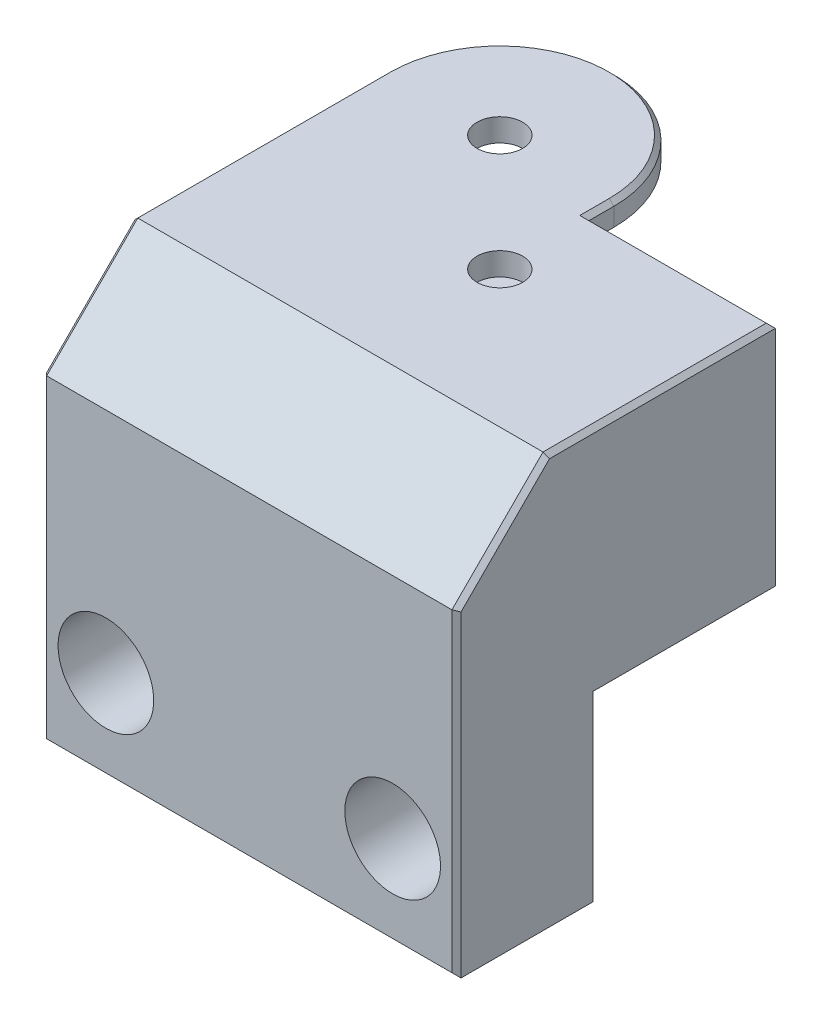
ISO-10303-21;
HEADER;
FILE_DESCRIPTION(('STEP AP214'),'2;1');
FILE_NAME('part.step','',(''),(''),'','','');
FILE_SCHEMA(('AUTOMOTIVE_DESIGN { 1 0 10303 214 1 1 1 1 }'));
ENDSEC;
DATA;
#1=APPLICATION_CONTEXT('core data for automotive mechanical design processes');
#2=APPLICATION_PROTOCOL_DEFINITION('international standard','automotive_design',2000,#1);
#3=PRODUCT_CONTEXT('',#1,'mechanical');
#4=PRODUCT('Part','Part','',(#3));
#5=PRODUCT_RELATED_PRODUCT_CATEGORY('part','',(#4));
#6=PRODUCT_DEFINITION_FORMATION('','',#4);
#7=PRODUCT_DEFINITION_CONTEXT('part definition',#1,'design');
#8=PRODUCT_DEFINITION('design','',#6,#7);
#9=PRODUCT_DEFINITION_SHAPE('','',#8);
#10=(LENGTH_UNIT() NAMED_UNIT(*) SI_UNIT(.MILLI.,.METRE.));
#11=(NAMED_UNIT(*) PLANE_ANGLE_UNIT() SI_UNIT($,.RADIAN.));
#12=(NAMED_UNIT(*) SI_UNIT($,.STERADIAN.) SOLID_ANGLE_UNIT());
#13=UNCERTAINTY_MEASURE_WITH_UNIT(LENGTH_MEASURE(1.E-05),#10,'distance_accuracy_value','');
#14=(GEOMETRIC_REPRESENTATION_CONTEXT(3) GLOBAL_UNCERTAINTY_ASSIGNED_CONTEXT((#13)) GLOBAL_UNIT_ASSIGNED_CONTEXT((#10,
#11,#12)) REPRESENTATION_CONTEXT('',''));
#15=CARTESIAN_POINT('',(0.,0.,0.));
#16=DIRECTION('',(0.,0.,1.));
#17=DIRECTION('',(1.,0.,0.));
#18=AXIS2_PLACEMENT_3D('',#15,#16,#17);
#19=CARTESIAN_POINT('',(50.2552086709145,-29.2919488059329,-12.7323956645428));
#20=DIRECTION('',(1.,0.,0.));
#21=DIRECTION('',(0.,0.,1.));
#22=AXIS2_PLACEMENT_3D('',#19,#20,#21);
#23=PLANE('',#22);
#24=DIRECTION('',(0.,0.,1.));
#25=VECTOR('',#24,1.);
#26=CARTESIAN_POINT('',(50.2552086709145,3.,-12.7323956645428));
#27=LINE('',#26,#25);
#28=CARTESIAN_POINT('',(50.2552086709145,3.,-12.7323956645428));
#29=VERTEX_POINT('',#28);
#30=CARTESIAN_POINT('',(50.2552086709145,3.,-10.));
#31=VERTEX_POINT('',#30);
#32=EDGE_CURVE('E254',#29,#31,#27,.T.);
#33=ORIENTED_EDGE('',*,*,#32,.T.);
#34=DIRECTION('',(0.,1.,0.));
#35=VECTOR('',#34,1.);
#36=CARTESIAN_POINT('',(50.2552086709145,-29.2919488059329,-10.));
#37=LINE('',#36,#35);
#38=CARTESIAN_POINT('',(50.2552086709145,0.,-10.));
#39=VERTEX_POINT('',#38);
#40=EDGE_CURVE('E272',#39,#31,#37,.T.);
#41=ORIENTED_EDGE('',*,*,#40,.F.);
#42=DIRECTION('',(0.,0.,-1.));
#43=VECTOR('',#42,1.);
#44=CARTESIAN_POINT('',(50.2552086709145,0.,-12.7323956645428));
#45=LINE('',#44,#43);
#46=CARTESIAN_POINT('',(50.2552086709145,0.,-12.7323956645428));
#47=VERTEX_POINT('',#46);
#48=EDGE_CURVE('E258',#39,#47,#45,.T.);
#49=ORIENTED_EDGE('',*,*,#48,.T.);
#50=DIRECTION('',(0.,1.,0.));
#51=VECTOR('',#50,1.);
#52=CARTESIAN_POINT('',(50.2552086709145,-29.2919488059329,-12.7323956645428));
#53=LINE('',#52,#51);
#54=EDGE_CURVE('E275',#47,#29,#53,.T.);
#55=ORIENTED_EDGE('',*,*,#54,.T.);
#56=EDGE_LOOP('',(#33,#41,#49,#55));
#57=FACE_BOUND('',#56,.T.);
#58=ADVANCED_FACE('F33',(#57),#23,.T.);
#59=CARTESIAN_POINT('',(37.7476043354572,-29.2919488059329,-12.7323956645428));
#60=DIRECTION('',(0.,1.,0.));
#61=DIRECTION('',(0.,0.,1.));
#62=AXIS2_PLACEMENT_3D('',#59,#60,#61);
#63=CYLINDRICAL_SURFACE('',#62,12.5076043354572);
#64=CARTESIAN_POINT('',(37.7476043354572,3.,-12.7323956645428));
#65=DIRECTION('',(0.,1.,0.));
#66=DIRECTION('',(0.,0.,-1.));
#67=AXIS2_PLACEMENT_3D('',#64,#65,#66);
#68=CIRCLE('',#67,12.5076043354572);
#69=CARTESIAN_POINT('',(25.24,3.,-12.7323956645428));
#70=VERTEX_POINT('',#69);
#71=EDGE_CURVE('E252',#70,#29,#68,.F.);
#72=ORIENTED_EDGE('',*,*,#71,.T.);
#73=ORIENTED_EDGE('',*,*,#54,.F.);
#74=CARTESIAN_POINT('',(37.7476043354572,0.,-12.7323956645428));
#75=DIRECTION('',(0.,-1.,0.));
#76=DIRECTION('',(0.,0.,1.));
#77=AXIS2_PLACEMENT_3D('',#74,#75,#76);
#78=CIRCLE('',#77,12.5076043354572);
#79=CARTESIAN_POINT('',(25.24,0.,-12.7323956645428));
#80=VERTEX_POINT('',#79);
#81=EDGE_CURVE('E262',#47,#80,#78,.F.);
#82=ORIENTED_EDGE('',*,*,#81,.T.);
#83=DIRECTION('',(0.,1.,0.));
#84=VECTOR('',#83,1.);
#85=CARTESIAN_POINT('',(25.24,-29.2919488059329,-12.7323956645428));
#86=LINE('',#85,#84);
#87=EDGE_CURVE('E265',#80,#70,#86,.T.);
#88=ORIENTED_EDGE('',*,*,#87,.T.);
#89=EDGE_LOOP('',(#72,#73,#82,#88));
#90=FACE_BOUND('',#89,.T.);
#91=ADVANCED_FACE('F487',(#90),#63,.T.);
#92=CARTESIAN_POINT('',(37.7476043354572,-29.2919488059329,-12.7323956645428));
#93=DIRECTION('',(0.,1.,0.));
#94=DIRECTION('',(0.,0.,1.));
#95=AXIS2_PLACEMENT_3D('',#92,#93,#94);
#96=CYLINDRICAL_SURFACE('',#95,2.5);
#97=CARTESIAN_POINT('',(37.7476043354572,3.,-12.7323956645428));
#98=DIRECTION('',(0.,1.,0.));
#99=DIRECTION('',(0.,0.,-1.));
#100=AXIS2_PLACEMENT_3D('',#97,#98,#99);
#101=CIRCLE('',#100,2.5);
#102=CARTESIAN_POINT('',(37.7476043354572,3.,-15.2323956645428));
#103=VERTEX_POINT('',#102);
#104=EDGE_CURVE('E251',#103,#103,#101,.F.);
#105=ORIENTED_EDGE('',*,*,#104,.F.);
#106=EDGE_LOOP('',(#105));
#107=FACE_BOUND('',#106,.T.);
#108=CARTESIAN_POINT('',(37.7476043354572,0.,-12.7323956645428));
#109=DIRECTION('',(0.,-1.,0.));
#110=DIRECTION('',(0.,0.,1.));
#111=AXIS2_PLACEMENT_3D('',#108,#109,#110);
#112=CIRCLE('',#111,2.5);
#113=CARTESIAN_POINT('',(37.7476043354572,0.,-10.2323956645428));
#114=VERTEX_POINT('',#113);
#115=EDGE_CURVE('E261',#114,#114,#112,.F.);
#116=ORIENTED_EDGE('',*,*,#115,.F.);
#117=EDGE_LOOP('',(#116));
#118=FACE_BOUND('',#117,.T.);
#119=ADVANCED_FACE('F546',(#107,#118),#96,.F.);
#120=CARTESIAN_POINT('',(70.72,25.,-10.));
#121=DIRECTION('',(0.,0.,1.));
#122=DIRECTION('',(-1.,0.,0.));
#123=AXIS2_PLACEMENT_3D('',#120,#121,#122);
#124=PLANE('',#123);
#125=CARTESIAN_POINT('',(50.2552086709145,22.5,-10.));
#126=VERTEX_POINT('',#125);
#127=CARTESIAN_POINT('',(50.2552086709145,24.5,-10.));
#128=VERTEX_POINT('',#127);
#129=EDGE_CURVE('E276',#126,#128,#37,.T.);
#130=ORIENTED_EDGE('',*,*,#129,.T.);
#131=DIRECTION('',(1.,0.,0.));
#132=VECTOR('',#131,1.);
#133=CARTESIAN_POINT('',(70.72,24.5,-10.));
#134=LINE('',#133,#132);
#135=CARTESIAN_POINT('',(70.72,24.5,-10.));
#136=VERTEX_POINT('',#135);
#137=EDGE_CURVE('E11',#128,#136,#134,.T.);
#138=ORIENTED_EDGE('',*,*,#137,.T.);
#139=DIRECTION('',(0.,-1.,0.));
#140=VECTOR('',#139,1.);
#141=CARTESIAN_POINT('',(70.72,25.,-10.));
#142=LINE('',#141,#140);
#143=CARTESIAN_POINT('',(70.72,0.,-10.));
#144=VERTEX_POINT('',#143);
#145=EDGE_CURVE('E334',#136,#144,#142,.T.);
#146=ORIENTED_EDGE('',*,*,#145,.T.);
#147=DIRECTION('',(1.,0.,0.));
#148=VECTOR('',#147,1.);
#149=CARTESIAN_POINT('',(70.72,0.,-10.));
#150=LINE('',#149,#148);
#151=EDGE_CURVE('E328',#39,#144,#150,.T.);
#152=ORIENTED_EDGE('',*,*,#151,.F.);
#153=ORIENTED_EDGE('',*,*,#40,.T.);
#154=DIRECTION('',(1.,0.,0.));
#155=VECTOR('',#154,1.);
#156=CARTESIAN_POINT('',(40.32,3.,-10.));
#157=LINE('',#156,#155);
#158=CARTESIAN_POINT('',(60.64,3.,-10.));
#159=VERTEX_POINT('',#158);
#160=EDGE_CURVE('E285',#31,#159,#157,.T.);
#161=ORIENTED_EDGE('',*,*,#160,.T.);
#162=DIRECTION('',(0.,1.,0.));
#163=VECTOR('',#162,1.);
#164=CARTESIAN_POINT('',(60.64,3.,-10.));
#165=LINE('',#164,#163);
#166=CARTESIAN_POINT('',(60.64,22.5,-10.));
#167=VERTEX_POINT('',#166);
#168=EDGE_CURVE('E291',#159,#167,#165,.T.);
#169=ORIENTED_EDGE('',*,*,#168,.T.);
#170=DIRECTION('',(1.,0.,0.));
#171=VECTOR('',#170,1.);
#172=CARTESIAN_POINT('',(40.32,22.5,-10.));
#173=LINE('',#172,#171);
#174=EDGE_CURVE('E294',#126,#167,#173,.T.);
#175=ORIENTED_EDGE('',*,*,#174,.F.);
#176=EDGE_LOOP('',(#130,#138,#146,#152,#153,#161,#169,#175));
#177=FACE_BOUND('',#176,.T.);
#178=ADVANCED_FACE('F478',(#177),#124,.F.);
#179=CARTESIAN_POINT('',(50.48,25.,0.));
#180=DIRECTION('',(0.,-1.,0.));
#181=DIRECTION('',(0.,0.,-1.));
#182=AXIS2_PLACEMENT_3D('',#179,#180,#181);
#183=CYLINDRICAL_SURFACE('',#182,2.5);
#184=CARTESIAN_POINT('',(50.48,25.,0.));
#185=DIRECTION('',(0.,-1.,0.));
#186=DIRECTION('',(0.,0.,1.));
#187=AXIS2_PLACEMENT_3D('',#184,#185,#186);
#188=CIRCLE('',#187,2.5);
#189=CARTESIAN_POINT('',(50.48,25.,2.5));
#190=VERTEX_POINT('',#189);
#191=EDGE_CURVE('E318',#190,#190,#188,.T.);
#192=ORIENTED_EDGE('',*,*,#191,.F.);
#193=EDGE_LOOP('',(#192));
#194=FACE_BOUND('',#193,.T.);
#195=CARTESIAN_POINT('',(50.48,22.5,0.));
#196=DIRECTION('',(0.,1.,0.));
#197=DIRECTION('',(0.,0.,-1.));
#198=AXIS2_PLACEMENT_3D('',#195,#196,#197);
#199=CIRCLE('',#198,2.5);
#200=CARTESIAN_POINT('',(50.48,22.5,-2.5));
#201=VERTEX_POINT('',#200);
#202=EDGE_CURVE('E301',#201,#201,#199,.T.);
#203=ORIENTED_EDGE('',*,*,#202,.F.);
#204=EDGE_LOOP('',(#203));
#205=FACE_BOUND('',#204,.T.);
#206=ADVANCED_FACE('F555',(#194,#205),#183,.F.);
#207=CARTESIAN_POINT('',(50.48,25.,0.));
#208=DIRECTION('',(0.,1.,0.));
#209=DIRECTION('',(0.,0.,1.));
#210=AXIS2_PLACEMENT_3D('',#207,#208,#209);
#211=PLANE('',#210);
#212=CARTESIAN_POINT('',(37.7476043354572,25.,-12.7323956645428));
#213=DIRECTION('',(0.,1.,0.));
#214=DIRECTION('',(0.,0.,1.));
#215=AXIS2_PLACEMENT_3D('',#212,#213,#214);
#216=CIRCLE('',#215,12.0076043354572);
#217=CARTESIAN_POINT('',(49.7552086709145,25.,-12.7323956645428));
#218=VERTEX_POINT('',#217);
#219=CARTESIAN_POINT('',(25.74,25.,-12.7323956645428));
#220=VERTEX_POINT('',#219);
#221=EDGE_CURVE('E377',#218,#220,#216,.T.);
#222=ORIENTED_EDGE('',*,*,#221,.T.);
#223=DIRECTION('',(0.,0.,1.));
#224=VECTOR('',#223,1.);
#225=CARTESIAN_POINT('',(25.74,25.,14.9999999999999));
#226=LINE('',#225,#224);
#227=CARTESIAN_POINT('',(25.74,25.,14.9999999999999));
#228=VERTEX_POINT('',#227);
#229=EDGE_CURVE('E379',#220,#228,#226,.T.);
#230=ORIENTED_EDGE('',*,*,#229,.T.);
#231=DIRECTION('',(-1.,0.,0.));
#232=VECTOR('',#231,1.);
#233=CARTESIAN_POINT('',(50.48,25.,14.9999999999999));
#234=LINE('',#233,#232);
#235=CARTESIAN_POINT('',(70.22,25.,14.9999999999999));
#236=VERTEX_POINT('',#235);
#237=EDGE_CURVE('E343',#236,#228,#234,.T.);
#238=ORIENTED_EDGE('',*,*,#237,.F.);
#239=DIRECTION('',(0.,0.,-1.));
#240=VECTOR('',#239,1.);
#241=CARTESIAN_POINT('',(70.22,25.,-10.));
#242=LINE('',#241,#240);
#243=CARTESIAN_POINT('',(70.22,25.,-9.5));
#244=VERTEX_POINT('',#243);
#245=EDGE_CURVE('E371',#236,#244,#242,.T.);
#246=ORIENTED_EDGE('',*,*,#245,.T.);
#247=DIRECTION('',(-1.,0.,0.));
#248=VECTOR('',#247,1.);
#249=CARTESIAN_POINT('',(50.2552086709145,25.,-9.5));
#250=LINE('',#249,#248);
#251=CARTESIAN_POINT('',(49.7552086709145,25.,-9.5));
#252=VERTEX_POINT('',#251);
#253=EDGE_CURVE('E373',#244,#252,#250,.T.);
#254=ORIENTED_EDGE('',*,*,#253,.T.);
#255=DIRECTION('',(0.,0.,-1.));
#256=VECTOR('',#255,1.);
#257=CARTESIAN_POINT('',(49.7552086709145,25.,0.));
#258=LINE('',#257,#256);
#259=EDGE_CURVE('E375',#252,#218,#258,.T.);
#260=ORIENTED_EDGE('',*,*,#259,.T.);
#261=EDGE_LOOP('',(#222,#230,#238,#246,#254,#260));
#262=FACE_BOUND('',#261,.T.);
#263=ORIENTED_EDGE('',*,*,#191,.T.);
#264=EDGE_LOOP('',(#263));
#265=FACE_BOUND('',#264,.T.);
#266=CARTESIAN_POINT('',(37.7476043354572,25.,-12.7323956645428));
#267=DIRECTION('',(0.,-1.,0.));
#268=DIRECTION('',(0.,0.,1.));
#269=AXIS2_PLACEMENT_3D('',#266,#267,#268);
#270=CIRCLE('',#269,2.5);
#271=CARTESIAN_POINT('',(37.7476043354572,25.,-10.2323956645428));
#272=VERTEX_POINT('',#271);
#273=EDGE_CURVE('E257',#272,#272,#270,.T.);
#274=ORIENTED_EDGE('',*,*,#273,.T.);
#275=EDGE_LOOP('',(#274));
#276=FACE_BOUND('',#275,.T.);
#277=ADVANCED_FACE('F515',(#262,#265,#276),#211,.T.);
#278=CARTESIAN_POINT('',(50.48,0.,0.));
#279=DIRECTION('',(0.,1.,0.));
#280=DIRECTION('',(0.,0.,1.));
#281=AXIS2_PLACEMENT_3D('',#278,#279,#280);
#282=PLANE('',#281);
#283=DIRECTION('',(-1.,0.,0.));
#284=VECTOR('',#283,1.);
#285=CARTESIAN_POINT('',(30.24,0.,10.));
#286=LINE('',#285,#284);
#287=CARTESIAN_POINT('',(70.72,0.,10.));
#288=VERTEX_POINT('',#287);
#289=CARTESIAN_POINT('',(25.24,0.,9.99999999999997));
#290=VERTEX_POINT('',#289);
#291=EDGE_CURVE('E321',#288,#290,#286,.T.);
#292=ORIENTED_EDGE('',*,*,#291,.T.);
#293=DIRECTION('',(0.,0.,-1.));
#294=VECTOR('',#293,1.);
#295=CARTESIAN_POINT('',(25.24,0.,10.));
#296=LINE('',#295,#294);
#297=EDGE_CURVE('E326',#290,#80,#296,.T.);
#298=ORIENTED_EDGE('',*,*,#297,.T.);
#299=ORIENTED_EDGE('',*,*,#81,.F.);
#300=ORIENTED_EDGE('',*,*,#48,.F.);
#301=ORIENTED_EDGE('',*,*,#151,.T.);
#302=DIRECTION('',(0.,0.,1.));
#303=VECTOR('',#302,1.);
#304=CARTESIAN_POINT('',(70.72,0.,-10.));
#305=LINE('',#304,#303);
#306=EDGE_CURVE('E331',#144,#288,#305,.T.);
#307=ORIENTED_EDGE('',*,*,#306,.T.);
#308=EDGE_LOOP('',(#292,#298,#299,#300,#301,#307));
#309=FACE_BOUND('',#308,.T.);
#310=CARTESIAN_POINT('',(50.48,0.,0.));
#311=DIRECTION('',(0.,-1.,0.));
#312=DIRECTION('',(0.,0.,1.));
#313=AXIS2_PLACEMENT_3D('',#310,#311,#312);
#314=CIRCLE('',#313,2.5);
#315=CARTESIAN_POINT('',(50.48,0.,2.5));
#316=VERTEX_POINT('',#315);
#317=EDGE_CURVE('E317',#316,#316,#314,.T.);
#318=ORIENTED_EDGE('',*,*,#317,.F.);
#319=EDGE_LOOP('',(#318));
#320=FACE_BOUND('',#319,.T.);
#321=ORIENTED_EDGE('',*,*,#115,.T.);
#322=EDGE_LOOP('',(#321));
#323=FACE_BOUND('',#322,.T.);
#324=ADVANCED_FACE('F538',(#309,#320,#323),#282,.F.);
#325=CARTESIAN_POINT('',(25.24,25.,10.));
#326=DIRECTION('',(1.,0.,0.));
#327=DIRECTION('',(0.,0.,1.));
#328=AXIS2_PLACEMENT_3D('',#325,#326,#327);
#329=PLANE('',#328);
#330=DIRECTION('',(0.,0.707106781186546,-0.707106781186549));
#331=VECTOR('',#330,1.);
#332=CARTESIAN_POINT('',(25.24,24.6464466094067,14.6464466094067));
#333=LINE('',#332,#331);
#334=CARTESIAN_POINT('',(25.24,14.7928932188135,24.5));
#335=VERTEX_POINT('',#334);
#336=CARTESIAN_POINT('',(25.24,24.5,14.7928932188134));
#337=VERTEX_POINT('',#336);
#338=EDGE_CURVE('E366',#335,#337,#333,.T.);
#339=ORIENTED_EDGE('',*,*,#338,.T.);
#340=DIRECTION('',(0.,0.,-1.));
#341=VECTOR('',#340,1.);
#342=CARTESIAN_POINT('',(25.24,24.5,-12.7323956645428));
#343=LINE('',#342,#341);
#344=CARTESIAN_POINT('',(25.24,24.5,-12.7323956645428));
#345=VERTEX_POINT('',#344);
#346=EDGE_CURVE('E368',#337,#345,#343,.T.);
#347=ORIENTED_EDGE('',*,*,#346,.T.);
#348=CARTESIAN_POINT('',(25.24,22.5,-12.7323956645428));
#349=VERTEX_POINT('',#348);
#350=EDGE_CURVE('E271',#349,#345,#86,.T.);
#351=ORIENTED_EDGE('',*,*,#350,.F.);
#352=DIRECTION('',(0.,0.,1.));
#353=VECTOR('',#352,1.);
#354=CARTESIAN_POINT('',(25.24,22.5,10.16));
#355=LINE('',#354,#353);
#356=CARTESIAN_POINT('',(25.24,22.5,-3.));
#357=VERTEX_POINT('',#356);
#358=EDGE_CURVE('E232',#349,#357,#355,.T.);
#359=ORIENTED_EDGE('',*,*,#358,.T.);
#360=DIRECTION('',(0.,1.,0.));
#361=VECTOR('',#360,1.);
#362=CARTESIAN_POINT('',(25.24,-13.2297997523075,-3.));
#363=LINE('',#362,#361);
#364=CARTESIAN_POINT('',(25.24,3.,-3.));
#365=VERTEX_POINT('',#364);
#366=EDGE_CURVE('E224',#365,#357,#363,.T.);
#367=ORIENTED_EDGE('',*,*,#366,.F.);
#368=DIRECTION('',(0.,0.,-1.));
#369=VECTOR('',#368,1.);
#370=CARTESIAN_POINT('',(25.24,3.,10.16));
#371=LINE('',#370,#369);
#372=EDGE_CURVE('E230',#365,#70,#371,.T.);
#373=ORIENTED_EDGE('',*,*,#372,.T.);
#374=ORIENTED_EDGE('',*,*,#87,.F.);
#375=ORIENTED_EDGE('',*,*,#297,.F.);
#376=DIRECTION('',(0.,1.,0.));
#377=VECTOR('',#376,1.);
#378=CARTESIAN_POINT('',(25.24,25.,9.99999999999997));
#379=LINE('',#378,#377);
#380=CARTESIAN_POINT('',(25.24,-20.,9.99999999999997));
#381=VERTEX_POINT('',#380);
#382=EDGE_CURVE('E311',#381,#290,#379,.T.);
#383=ORIENTED_EDGE('',*,*,#382,.F.);
#384=DIRECTION('',(0.,0.,-1.));
#385=VECTOR('',#384,1.);
#386=CARTESIAN_POINT('',(25.24,-20.,25.));
#387=LINE('',#386,#385);
#388=CARTESIAN_POINT('',(25.24,-20.,24.5));
#389=VERTEX_POINT('',#388);
#390=EDGE_CURVE('E313',#389,#381,#387,.T.);
#391=ORIENTED_EDGE('',*,*,#390,.F.);
#392=DIRECTION('',(0.,1.,0.));
#393=VECTOR('',#392,1.);
#394=CARTESIAN_POINT('',(25.24,15.,24.5));
#395=LINE('',#394,#393);
#396=EDGE_CURVE('E356',#389,#335,#395,.T.);
#397=ORIENTED_EDGE('',*,*,#396,.T.);
#398=EDGE_LOOP('',(#339,#347,#351,#359,#367,#373,#374,#375,#383,#391,#397));
#399=FACE_BOUND('',#398,.T.);
#400=CARTESIAN_POINT('',(25.24,22.5,3.));
#401=VERTEX_POINT('',#400);
#402=CARTESIAN_POINT('',(25.24,22.5,10.16));
#403=VERTEX_POINT('',#402);
#404=EDGE_CURVE('E229',#401,#403,#355,.T.);
#405=ORIENTED_EDGE('',*,*,#404,.T.);
#406=DIRECTION('',(0.,-1.,0.));
#407=VECTOR('',#406,1.);
#408=CARTESIAN_POINT('',(25.24,3.,10.16));
#409=LINE('',#408,#407);
#410=CARTESIAN_POINT('',(25.24,3.,10.16));
#411=VERTEX_POINT('',#410);
#412=EDGE_CURVE('E228',#403,#411,#409,.T.);
#413=ORIENTED_EDGE('',*,*,#412,.T.);
#414=CARTESIAN_POINT('',(25.24,3.,3.));
#415=VERTEX_POINT('',#414);
#416=EDGE_CURVE('E208',#411,#415,#371,.T.);
#417=ORIENTED_EDGE('',*,*,#416,.T.);
#418=DIRECTION('',(0.,1.,0.));
#419=VECTOR('',#418,1.);
#420=CARTESIAN_POINT('',(25.24,-13.2297997523075,3.));
#421=LINE('',#420,#419);
#422=EDGE_CURVE('E214',#415,#401,#421,.T.);
#423=ORIENTED_EDGE('',*,*,#422,.T.);
#424=EDGE_LOOP('',(#405,#413,#417,#423));
#425=FACE_BOUND('',#424,.T.);
#426=ADVANCED_FACE('F226',(#399,#425),#329,.F.);
#427=CARTESIAN_POINT('',(70.72,25.,-10.));
#428=DIRECTION('',(-1.,0.,0.));
#429=DIRECTION('',(0.,0.,-1.));
#430=AXIS2_PLACEMENT_3D('',#427,#428,#429);
#431=PLANE('',#430);
#432=DIRECTION('',(0.,-0.707106781186546,0.707106781186549));
#433=VECTOR('',#432,1.);
#434=CARTESIAN_POINT('',(70.72,14.6464466094067,24.6464466094067));
#435=LINE('',#434,#433);
#436=CARTESIAN_POINT('',(70.72,24.5,14.7928932188134));
#437=VERTEX_POINT('',#436);
#438=CARTESIAN_POINT('',(70.72,14.7928932188135,24.5));
#439=VERTEX_POINT('',#438);
#440=EDGE_CURVE('E396',#437,#439,#435,.T.);
#441=ORIENTED_EDGE('',*,*,#440,.T.);
#442=DIRECTION('',(0.,-1.,0.));
#443=VECTOR('',#442,1.);
#444=CARTESIAN_POINT('',(70.72,-20.,24.5));
#445=LINE('',#444,#443);
#446=CARTESIAN_POINT('',(70.72,-20.,24.5));
#447=VERTEX_POINT('',#446);
#448=EDGE_CURVE('E398',#439,#447,#445,.T.);
#449=ORIENTED_EDGE('',*,*,#448,.T.);
#450=DIRECTION('',(0.,0.,-1.));
#451=VECTOR('',#450,1.);
#452=CARTESIAN_POINT('',(70.72,-20.,25.));
#453=LINE('',#452,#451);
#454=CARTESIAN_POINT('',(70.72,-20.,9.99999999999997));
#455=VERTEX_POINT('',#454);
#456=EDGE_CURVE('E315',#447,#455,#453,.T.);
#457=ORIENTED_EDGE('',*,*,#456,.T.);
#458=DIRECTION('',(0.,-1.,0.));
#459=VECTOR('',#458,1.);
#460=CARTESIAN_POINT('',(70.72,25.,9.99999999999997));
#461=LINE('',#460,#459);
#462=EDGE_CURVE('E304',#288,#455,#461,.T.);
#463=ORIENTED_EDGE('',*,*,#462,.F.);
#464=ORIENTED_EDGE('',*,*,#306,.F.);
#465=ORIENTED_EDGE('',*,*,#145,.F.);
#466=DIRECTION('',(0.,0.,1.));
#467=VECTOR('',#466,1.);
#468=CARTESIAN_POINT('',(70.72,24.5,14.9999999999999));
#469=LINE('',#468,#467);
#470=EDGE_CURVE('E394',#136,#437,#469,.T.);
#471=ORIENTED_EDGE('',*,*,#470,.T.);
#472=EDGE_LOOP('',(#441,#449,#457,#463,#464,#465,#471));
#473=FACE_BOUND('',#472,.T.);
#474=ADVANCED_FACE('F522',(#473),#431,.F.);
#475=CARTESIAN_POINT('',(50.48,3.,0.));
#476=DIRECTION('',(0.,1.,0.));
#477=DIRECTION('',(0.,0.,-1.));
#478=AXIS2_PLACEMENT_3D('',#475,#476,#477);
#479=CIRCLE('',#478,2.5);
#480=CARTESIAN_POINT('',(50.48,3.,-2.5));
#481=VERTEX_POINT('',#480);
#482=EDGE_CURVE('E308',#481,#481,#479,.T.);
#483=ORIENTED_EDGE('',*,*,#482,.T.);
#484=EDGE_LOOP('',(#483));
#485=FACE_BOUND('',#484,.T.);
#486=ORIENTED_EDGE('',*,*,#317,.T.);
#487=EDGE_LOOP('',(#486));
#488=FACE_BOUND('',#487,.T.);
#489=ADVANCED_FACE('F587',(#485,#488),#183,.F.);
#490=CARTESIAN_POINT('',(50.48,0.,9.99999999999997));
#491=DIRECTION('',(0.,0.,1.));
#492=DIRECTION('',(-1.,0.,0.));
#493=AXIS2_PLACEMENT_3D('',#490,#491,#492);
#494=PLANE('',#493);
#495=CARTESIAN_POINT('',(63.72,-10.,9.99999999999997));
#496=DIRECTION('',(0.,0.,-1.));
#497=DIRECTION('',(-1.,0.,0.));
#498=AXIS2_PLACEMENT_3D('',#495,#496,#497);
#499=CIRCLE('',#498,2.74999999999999);
#500=CARTESIAN_POINT('',(60.97,-10.,9.99999999999997));
#501=VERTEX_POINT('',#500);
#502=EDGE_CURVE('E360',#501,#501,#499,.T.);
#503=ORIENTED_EDGE('',*,*,#502,.F.);
#504=EDGE_LOOP('',(#503));
#505=FACE_BOUND('',#504,.T.);
#506=CARTESIAN_POINT('',(32.24,-10.,9.99999999999997));
#507=DIRECTION('',(0.,0.,-1.));
#508=DIRECTION('',(-1.,0.,0.));
#509=AXIS2_PLACEMENT_3D('',#506,#507,#508);
#510=CIRCLE('',#509,2.74999999999999);
#511=CARTESIAN_POINT('',(29.49,-10.,9.99999999999997));
#512=VERTEX_POINT('',#511);
#513=EDGE_CURVE('E215',#512,#512,#510,.T.);
#514=ORIENTED_EDGE('',*,*,#513,.F.);
#515=EDGE_LOOP('',(#514));
#516=FACE_BOUND('',#515,.T.);
#517=ORIENTED_EDGE('',*,*,#462,.T.);
#518=DIRECTION('',(-1.,0.,0.));
#519=VECTOR('',#518,1.);
#520=CARTESIAN_POINT('',(70.72,-20.,9.99999999999997));
#521=LINE('',#520,#519);
#522=EDGE_CURVE('E307',#455,#381,#521,.T.);
#523=ORIENTED_EDGE('',*,*,#522,.T.);
#524=ORIENTED_EDGE('',*,*,#382,.T.);
#525=ORIENTED_EDGE('',*,*,#291,.F.);
#526=EDGE_LOOP('',(#517,#523,#524,#525));
#527=FACE_BOUND('',#526,.T.);
#528=ADVANCED_FACE('F536',(#505,#516,#527),#494,.F.);
#529=CARTESIAN_POINT('',(70.72,-20.,25.));
#530=DIRECTION('',(0.,1.,0.));
#531=DIRECTION('',(0.,0.,1.));
#532=AXIS2_PLACEMENT_3D('',#529,#530,#531);
#533=PLANE('',#532);
#534=ORIENTED_EDGE('',*,*,#456,.F.);
#535=DIRECTION('',(-1.,0.,0.));
#536=VECTOR('',#535,1.);
#537=CARTESIAN_POINT('',(25.24,-20.,24.5));
#538=LINE('',#537,#536);
#539=EDGE_CURVE('E392',#447,#389,#538,.T.);
#540=ORIENTED_EDGE('',*,*,#539,.T.);
#541=ORIENTED_EDGE('',*,*,#390,.T.);
#542=ORIENTED_EDGE('',*,*,#522,.F.);
#543=EDGE_LOOP('',(#534,#540,#541,#542));
#544=FACE_BOUND('',#543,.T.);
#545=ADVANCED_FACE('F532',(#544),#533,.F.);
#546=CARTESIAN_POINT('',(50.48,0.,25.));
#547=DIRECTION('',(0.,0.,1.));
#548=DIRECTION('',(-1.,0.,0.));
#549=AXIS2_PLACEMENT_3D('',#546,#547,#548);
#550=PLANE('',#549);
#551=CARTESIAN_POINT('',(63.72,-10.,25.));
#552=DIRECTION('',(0.,0.,-1.));
#553=DIRECTION('',(-1.,0.,0.));
#554=AXIS2_PLACEMENT_3D('',#551,#552,#553);
#555=CIRCLE('',#554,5.25);
#556=CARTESIAN_POINT('',(58.47,-10.,25.));
#557=VERTEX_POINT('',#556);
#558=EDGE_CURVE('E430',#557,#557,#555,.T.);
#559=ORIENTED_EDGE('',*,*,#558,.T.);
#560=EDGE_LOOP('',(#559));
#561=FACE_BOUND('',#560,.T.);
#562=CARTESIAN_POINT('',(32.24,-10.,25.));
#563=DIRECTION('',(0.,0.,-1.));
#564=DIRECTION('',(-1.,0.,0.));
#565=AXIS2_PLACEMENT_3D('',#562,#563,#564);
#566=CIRCLE('',#565,5.25);
#567=CARTESIAN_POINT('',(26.99,-10.,25.));
#568=VERTEX_POINT('',#567);
#569=EDGE_CURVE('E363',#568,#568,#566,.T.);
#570=ORIENTED_EDGE('',*,*,#569,.T.);
#571=EDGE_LOOP('',(#570));
#572=FACE_BOUND('',#571,.T.);
#573=DIRECTION('',(1.,0.,0.));
#574=VECTOR('',#573,1.);
#575=CARTESIAN_POINT('',(50.48,15.,25.));
#576=LINE('',#575,#574);
#577=CARTESIAN_POINT('',(25.74,15.,25.));
#578=VERTEX_POINT('',#577);
#579=CARTESIAN_POINT('',(70.22,15.,25.));
#580=VERTEX_POINT('',#579);
#581=EDGE_CURVE('E340',#578,#580,#576,.T.);
#582=ORIENTED_EDGE('',*,*,#581,.F.);
#583=DIRECTION('',(0.,-1.,0.));
#584=VECTOR('',#583,1.);
#585=CARTESIAN_POINT('',(25.74,-20.,25.));
#586=LINE('',#585,#584);
#587=CARTESIAN_POINT('',(25.74,-19.5,25.));
#588=VERTEX_POINT('',#587);
#589=EDGE_CURVE('E390',#578,#588,#586,.T.);
#590=ORIENTED_EDGE('',*,*,#589,.T.);
#591=DIRECTION('',(1.,0.,0.));
#592=VECTOR('',#591,1.);
#593=CARTESIAN_POINT('',(70.72,-19.5,25.));
#594=LINE('',#593,#592);
#595=CARTESIAN_POINT('',(70.22,-19.5,25.));
#596=VERTEX_POINT('',#595);
#597=EDGE_CURVE('E388',#588,#596,#594,.T.);
#598=ORIENTED_EDGE('',*,*,#597,.T.);
#599=DIRECTION('',(0.,1.,0.));
#600=VECTOR('',#599,1.);
#601=CARTESIAN_POINT('',(70.22,15.,25.));
#602=LINE('',#601,#600);
#603=EDGE_CURVE('E386',#596,#580,#602,.T.);
#604=ORIENTED_EDGE('',*,*,#603,.T.);
#605=EDGE_LOOP('',(#582,#590,#598,#604));
#606=FACE_BOUND('',#605,.T.);
#607=ADVANCED_FACE('F582',(#561,#572,#606),#550,.T.);
#608=CARTESIAN_POINT('',(50.48,3.,0.));
#609=DIRECTION('',(0.,1.,0.));
#610=DIRECTION('',(0.,0.,1.));
#611=AXIS2_PLACEMENT_3D('',#608,#609,#610);
#612=CYLINDRICAL_SURFACE('',#611,10.16);
#613=CARTESIAN_POINT('',(50.48,22.5,0.));
#614=DIRECTION('',(0.,-1.,0.));
#615=DIRECTION('',(0.,0.,-1.));
#616=AXIS2_PLACEMENT_3D('',#613,#614,#615);
#617=CIRCLE('',#616,10.16);
#618=CARTESIAN_POINT('',(60.64,22.5,0.));
#619=VERTEX_POINT('',#618);
#620=CARTESIAN_POINT('',(50.48,22.5,10.16));
#621=VERTEX_POINT('',#620);
#622=EDGE_CURVE('E281',#619,#621,#617,.T.);
#623=ORIENTED_EDGE('',*,*,#622,.F.);
#624=DIRECTION('',(0.,1.,0.));
#625=VECTOR('',#624,1.);
#626=CARTESIAN_POINT('',(60.64,3.,0.));
#627=LINE('',#626,#625);
#628=CARTESIAN_POINT('',(60.64,3.,0.));
#629=VERTEX_POINT('',#628);
#630=EDGE_CURVE('E298',#629,#619,#627,.T.);
#631=ORIENTED_EDGE('',*,*,#630,.F.);
#632=CARTESIAN_POINT('',(50.48,3.,0.));
#633=DIRECTION('',(0.,-1.,0.));
#634=DIRECTION('',(0.,0.,-1.));
#635=AXIS2_PLACEMENT_3D('',#632,#633,#634);
#636=CIRCLE('',#635,10.16);
#637=CARTESIAN_POINT('',(50.48,3.,10.16));
#638=VERTEX_POINT('',#637);
#639=EDGE_CURVE('E282',#629,#638,#636,.T.);
#640=ORIENTED_EDGE('',*,*,#639,.T.);
#641=DIRECTION('',(0.,-1.,0.));
#642=VECTOR('',#641,1.);
#643=CARTESIAN_POINT('',(50.48,3.,10.16));
#644=LINE('',#643,#642);
#645=EDGE_CURVE('E238',#621,#638,#644,.T.);
#646=ORIENTED_EDGE('',*,*,#645,.F.);
#647=EDGE_LOOP('',(#623,#631,#640,#646));
#648=FACE_BOUND('',#647,.T.);
#649=ADVANCED_FACE('F473',(#648),#612,.F.);
#650=CARTESIAN_POINT('',(60.64,3.,-10.));
#651=DIRECTION('',(1.,0.,0.));
#652=DIRECTION('',(0.,0.,1.));
#653=AXIS2_PLACEMENT_3D('',#650,#651,#652);
#654=PLANE('',#653);
#655=DIRECTION('',(0.,0.,1.));
#656=VECTOR('',#655,1.);
#657=CARTESIAN_POINT('',(60.64,22.5,-10.));
#658=LINE('',#657,#656);
#659=EDGE_CURVE('E286',#167,#619,#658,.T.);
#660=ORIENTED_EDGE('',*,*,#659,.F.);
#661=ORIENTED_EDGE('',*,*,#168,.F.);
#662=DIRECTION('',(0.,0.,1.));
#663=VECTOR('',#662,1.);
#664=CARTESIAN_POINT('',(60.64,3.,-10.));
#665=LINE('',#664,#663);
#666=EDGE_CURVE('E289',#159,#629,#665,.T.);
#667=ORIENTED_EDGE('',*,*,#666,.T.);
#668=ORIENTED_EDGE('',*,*,#630,.T.);
#669=EDGE_LOOP('',(#660,#661,#667,#668));
#670=FACE_BOUND('',#669,.T.);
#671=ADVANCED_FACE('F475',(#670),#654,.F.);
#672=CARTESIAN_POINT('',(50.48,3.,0.));
#673=DIRECTION('',(0.,-1.,0.));
#674=DIRECTION('',(0.,0.,-1.));
#675=AXIS2_PLACEMENT_3D('',#672,#673,#674);
#676=PLANE('',#675);
#677=ORIENTED_EDGE('',*,*,#416,.F.);
#678=DIRECTION('',(-1.,0.,0.));
#679=VECTOR('',#678,1.);
#680=CARTESIAN_POINT('',(94.98,3.,10.16));
#681=LINE('',#680,#679);
#682=EDGE_CURVE('E241',#638,#411,#681,.T.);
#683=ORIENTED_EDGE('',*,*,#682,.F.);
#684=ORIENTED_EDGE('',*,*,#639,.F.);
#685=ORIENTED_EDGE('',*,*,#666,.F.);
#686=ORIENTED_EDGE('',*,*,#160,.F.);
#687=ORIENTED_EDGE('',*,*,#32,.F.);
#688=ORIENTED_EDGE('',*,*,#71,.F.);
#689=ORIENTED_EDGE('',*,*,#372,.F.);
#690=DIRECTION('',(1.,0.,0.));
#691=VECTOR('',#690,1.);
#692=CARTESIAN_POINT('',(40.32,3.,-3.));
#693=LINE('',#692,#691);
#694=CARTESIAN_POINT('',(40.32,3.,-3.));
#695=VERTEX_POINT('',#694);
#696=EDGE_CURVE('E454',#365,#695,#693,.T.);
#697=ORIENTED_EDGE('',*,*,#696,.T.);
#698=DIRECTION('',(0.,0.,1.));
#699=VECTOR('',#698,1.);
#700=CARTESIAN_POINT('',(40.32,3.,3.));
#701=LINE('',#700,#699);
#702=CARTESIAN_POINT('',(40.32,3.,3.));
#703=VERTEX_POINT('',#702);
#704=EDGE_CURVE('E212',#695,#703,#701,.T.);
#705=ORIENTED_EDGE('',*,*,#704,.T.);
#706=DIRECTION('',(-1.,0.,0.));
#707=VECTOR('',#706,1.);
#708=CARTESIAN_POINT('',(40.32,3.,3.));
#709=LINE('',#708,#707);
#710=EDGE_CURVE('E203',#703,#415,#709,.T.);
#711=ORIENTED_EDGE('',*,*,#710,.T.);
#712=EDGE_LOOP('',(#677,#683,#684,#685,#686,#687,#688,#689,#697,#705,#711));
#713=FACE_BOUND('',#712,.T.);
#714=ORIENTED_EDGE('',*,*,#482,.F.);
#715=EDGE_LOOP('',(#714));
#716=FACE_BOUND('',#715,.T.);
#717=ORIENTED_EDGE('',*,*,#104,.T.);
#718=EDGE_LOOP('',(#717));
#719=FACE_BOUND('',#718,.T.);
#720=ADVANCED_FACE('F205',(#713,#716,#719),#676,.F.);
#721=CARTESIAN_POINT('',(50.48,22.5,0.));
#722=DIRECTION('',(0.,-1.,0.));
#723=DIRECTION('',(0.,0.,-1.));
#724=AXIS2_PLACEMENT_3D('',#721,#722,#723);
#725=PLANE('',#724);
#726=DIRECTION('',(1.,0.,0.));
#727=VECTOR('',#726,1.);
#728=CARTESIAN_POINT('',(50.48,22.5,3.));
#729=LINE('',#728,#727);
#730=CARTESIAN_POINT('',(40.32,22.5,3.));
#731=VERTEX_POINT('',#730);
#732=EDGE_CURVE('E220',#401,#731,#729,.T.);
#733=ORIENTED_EDGE('',*,*,#732,.T.);
#734=DIRECTION('',(0.,0.,-1.));
#735=VECTOR('',#734,1.);
#736=CARTESIAN_POINT('',(40.32,22.5,0.));
#737=LINE('',#736,#735);
#738=CARTESIAN_POINT('',(40.32,22.5,-3.));
#739=VERTEX_POINT('',#738);
#740=EDGE_CURVE('E346',#731,#739,#737,.T.);
#741=ORIENTED_EDGE('',*,*,#740,.T.);
#742=DIRECTION('',(-1.,0.,0.));
#743=VECTOR('',#742,1.);
#744=CARTESIAN_POINT('',(50.48,22.5,-3.));
#745=LINE('',#744,#743);
#746=EDGE_CURVE('E353',#739,#357,#745,.T.);
#747=ORIENTED_EDGE('',*,*,#746,.T.);
#748=ORIENTED_EDGE('',*,*,#358,.F.);
#749=CARTESIAN_POINT('',(37.7476043354572,22.5,-12.7323956645428));
#750=DIRECTION('',(0.,-1.,0.));
#751=DIRECTION('',(0.,0.,1.));
#752=AXIS2_PLACEMENT_3D('',#749,#750,#751);
#753=CIRCLE('',#752,12.5076043354572);
#754=CARTESIAN_POINT('',(50.2552086709145,22.5,-12.7323956645428));
#755=VERTEX_POINT('',#754);
#756=EDGE_CURVE('E246',#755,#349,#753,.F.);
#757=ORIENTED_EDGE('',*,*,#756,.F.);
#758=DIRECTION('',(0.,0.,-1.));
#759=VECTOR('',#758,1.);
#760=CARTESIAN_POINT('',(50.2552086709145,22.5,-12.7323956645428));
#761=LINE('',#760,#759);
#762=EDGE_CURVE('E248',#126,#755,#761,.T.);
#763=ORIENTED_EDGE('',*,*,#762,.F.);
#764=ORIENTED_EDGE('',*,*,#174,.T.);
#765=ORIENTED_EDGE('',*,*,#659,.T.);
#766=ORIENTED_EDGE('',*,*,#622,.T.);
#767=DIRECTION('',(-1.,0.,0.));
#768=VECTOR('',#767,1.);
#769=CARTESIAN_POINT('',(94.98,22.5,10.16));
#770=LINE('',#769,#768);
#771=EDGE_CURVE('E242',#621,#403,#770,.T.);
#772=ORIENTED_EDGE('',*,*,#771,.T.);
#773=ORIENTED_EDGE('',*,*,#404,.F.);
#774=EDGE_LOOP('',(#733,#741,#747,#748,#757,#763,#764,#765,#766,#772,#773));
#775=FACE_BOUND('',#774,.T.);
#776=ORIENTED_EDGE('',*,*,#202,.T.);
#777=EDGE_LOOP('',(#776));
#778=FACE_BOUND('',#777,.T.);
#779=CARTESIAN_POINT('',(37.7476043354572,22.5,-12.7323956645428));
#780=DIRECTION('',(0.,-1.,0.));
#781=DIRECTION('',(0.,0.,1.));
#782=AXIS2_PLACEMENT_3D('',#779,#780,#781);
#783=CIRCLE('',#782,2.5);
#784=CARTESIAN_POINT('',(37.7476043354572,22.5,-10.2323956645428));
#785=VERTEX_POINT('',#784);
#786=EDGE_CURVE('E245',#785,#785,#783,.F.);
#787=ORIENTED_EDGE('',*,*,#786,.T.);
#788=EDGE_LOOP('',(#787));
#789=FACE_BOUND('',#788,.T.);
#790=ADVANCED_FACE('F463',(#775,#778,#789),#725,.T.);
#791=CARTESIAN_POINT('',(50.2552086709145,24.5,-12.7323956645428));
#792=VERTEX_POINT('',#791);
#793=EDGE_CURVE('E268',#755,#792,#53,.T.);
#794=ORIENTED_EDGE('',*,*,#793,.T.);
#795=DIRECTION('',(0.,0.,1.));
#796=VECTOR('',#795,1.);
#797=CARTESIAN_POINT('',(50.2552086709145,24.5,-12.7323956645428));
#798=LINE('',#797,#796);
#799=EDGE_CURVE('E42',#792,#128,#798,.T.);
#800=ORIENTED_EDGE('',*,*,#799,.T.);
#801=ORIENTED_EDGE('',*,*,#129,.F.);
#802=ORIENTED_EDGE('',*,*,#762,.T.);
#803=EDGE_LOOP('',(#794,#800,#801,#802));
#804=FACE_BOUND('',#803,.T.);
#805=ADVANCED_FACE('F501',(#804),#23,.T.);
#806=ORIENTED_EDGE('',*,*,#350,.T.);
#807=CARTESIAN_POINT('',(37.7476043354572,24.5,-12.7323956645428));
#808=DIRECTION('',(0.,1.,0.));
#809=DIRECTION('',(0.,0.,1.));
#810=AXIS2_PLACEMENT_3D('',#807,#808,#809);
#811=CIRCLE('',#810,12.5076043354572);
#812=EDGE_CURVE('E57',#345,#792,#811,.F.);
#813=ORIENTED_EDGE('',*,*,#812,.T.);
#814=ORIENTED_EDGE('',*,*,#793,.F.);
#815=ORIENTED_EDGE('',*,*,#756,.T.);
#816=EDGE_LOOP('',(#806,#813,#814,#815));
#817=FACE_BOUND('',#816,.T.);
#818=ADVANCED_FACE('F500',(#817),#63,.T.);
#819=ORIENTED_EDGE('',*,*,#786,.F.);
#820=EDGE_LOOP('',(#819));
#821=FACE_BOUND('',#820,.T.);
#822=ORIENTED_EDGE('',*,*,#273,.F.);
#823=EDGE_LOOP('',(#822));
#824=FACE_BOUND('',#823,.T.);
#825=ADVANCED_FACE('F550',(#821,#824),#96,.F.);
#826=CARTESIAN_POINT('',(50.48,15.,25.));
#827=DIRECTION('',(0.,-0.707106781186549,-0.707106781186546));
#828=DIRECTION('',(1.,0.,0.));
#829=AXIS2_PLACEMENT_3D('',#826,#827,#828);
#830=PLANE('',#829);
#831=ORIENTED_EDGE('',*,*,#237,.T.);
#832=DIRECTION('',(0.,0.707106781186546,-0.707106781186549));
#833=VECTOR('',#832,1.);
#834=CARTESIAN_POINT('',(25.74,15.,25.));
#835=LINE('',#834,#833);
#836=EDGE_CURVE('E384',#228,#578,#835,.F.);
#837=ORIENTED_EDGE('',*,*,#836,.T.);
#838=ORIENTED_EDGE('',*,*,#581,.T.);
#839=DIRECTION('',(0.,-0.707106781186546,0.707106781186549));
#840=VECTOR('',#839,1.);
#841=CARTESIAN_POINT('',(70.22,25.,14.9999999999999));
#842=LINE('',#841,#840);
#843=EDGE_CURVE('E382',#580,#236,#842,.F.);
#844=ORIENTED_EDGE('',*,*,#843,.T.);
#845=EDGE_LOOP('',(#831,#837,#838,#844));
#846=FACE_BOUND('',#845,.T.);
#847=ADVANCED_FACE('F562',(#846),#830,.F.);
#848=CARTESIAN_POINT('',(94.98,3.,10.16));
#849=DIRECTION('',(0.,0.,1.));
#850=DIRECTION('',(-1.,0.,0.));
#851=AXIS2_PLACEMENT_3D('',#848,#849,#850);
#852=PLANE('',#851);
#853=ORIENTED_EDGE('',*,*,#771,.F.);
#854=ORIENTED_EDGE('',*,*,#645,.T.);
#855=ORIENTED_EDGE('',*,*,#682,.T.);
#856=ORIENTED_EDGE('',*,*,#412,.F.);
#857=EDGE_LOOP('',(#853,#854,#855,#856));
#858=FACE_BOUND('',#857,.T.);
#859=ADVANCED_FACE('F468',(#858),#852,.F.);
#860=CARTESIAN_POINT('',(40.32,-13.2297997523075,3.));
#861=DIRECTION('',(0.,0.,1.));
#862=DIRECTION('',(-1.,0.,0.));
#863=AXIS2_PLACEMENT_3D('',#860,#861,#862);
#864=PLANE('',#863);
#865=ORIENTED_EDGE('',*,*,#422,.F.);
#866=ORIENTED_EDGE('',*,*,#710,.F.);
#867=DIRECTION('',(0.,1.,0.));
#868=VECTOR('',#867,1.);
#869=CARTESIAN_POINT('',(40.32,-13.2297997523075,3.));
#870=LINE('',#869,#868);
#871=EDGE_CURVE('E237',#703,#731,#870,.T.);
#872=ORIENTED_EDGE('',*,*,#871,.T.);
#873=ORIENTED_EDGE('',*,*,#732,.F.);
#874=EDGE_LOOP('',(#865,#866,#872,#873));
#875=FACE_BOUND('',#874,.T.);
#876=ADVANCED_FACE('F218',(#875),#864,.T.);
#877=CARTESIAN_POINT('',(40.32,-13.2297997523075,-3.));
#878=DIRECTION('',(0.,0.,-1.));
#879=DIRECTION('',(1.,0.,0.));
#880=AXIS2_PLACEMENT_3D('',#877,#878,#879);
#881=PLANE('',#880);
#882=DIRECTION('',(0.,1.,0.));
#883=VECTOR('',#882,1.);
#884=CARTESIAN_POINT('',(40.32,-13.2297997523075,-3.));
#885=LINE('',#884,#883);
#886=EDGE_CURVE('E453',#695,#739,#885,.T.);
#887=ORIENTED_EDGE('',*,*,#886,.F.);
#888=ORIENTED_EDGE('',*,*,#696,.F.);
#889=ORIENTED_EDGE('',*,*,#366,.T.);
#890=ORIENTED_EDGE('',*,*,#746,.F.);
#891=EDGE_LOOP('',(#887,#888,#889,#890));
#892=FACE_BOUND('',#891,.T.);
#893=ADVANCED_FACE('F495',(#892),#881,.T.);
#894=CARTESIAN_POINT('',(40.32,-13.2297997523075,3.));
#895=DIRECTION('',(1.,0.,0.));
#896=DIRECTION('',(0.,0.,1.));
#897=AXIS2_PLACEMENT_3D('',#894,#895,#896);
#898=PLANE('',#897);
#899=ORIENTED_EDGE('',*,*,#871,.F.);
#900=ORIENTED_EDGE('',*,*,#704,.F.);
#901=ORIENTED_EDGE('',*,*,#886,.T.);
#902=ORIENTED_EDGE('',*,*,#740,.F.);
#903=EDGE_LOOP('',(#899,#900,#901,#902));
#904=FACE_BOUND('',#903,.T.);
#905=ADVANCED_FACE('F460',(#904),#898,.T.);
#906=CARTESIAN_POINT('',(32.24,-10.,25.));
#907=DIRECTION('',(0.,0.,1.));
#908=DIRECTION('',(-1.,0.,0.));
#909=AXIS2_PLACEMENT_3D('',#906,#907,#908);
#910=CYLINDRICAL_SURFACE('',#909,2.74999999999999);
#911=CARTESIAN_POINT('',(32.24,-10.,15.25));
#912=DIRECTION('',(0.,0.,-1.));
#913=DIRECTION('',(-1.,0.,0.));
#914=AXIS2_PLACEMENT_3D('',#911,#912,#913);
#915=CIRCLE('',#914,2.75);
#916=CARTESIAN_POINT('',(29.49,-10.,15.25));
#917=VERTEX_POINT('',#916);
#918=EDGE_CURVE('E359',#917,#917,#915,.T.);
#919=ORIENTED_EDGE('',*,*,#918,.F.);
#920=EDGE_LOOP('',(#919));
#921=FACE_BOUND('',#920,.T.);
#922=ORIENTED_EDGE('',*,*,#513,.T.);
#923=EDGE_LOOP('',(#922));
#924=FACE_BOUND('',#923,.T.);
#925=ADVANCED_FACE('F657',(#921,#924),#910,.F.);
#926=CARTESIAN_POINT('',(29.49,-10.,15.25));
#927=DIRECTION('',(0.,0.,-1.));
#928=DIRECTION('',(1.,0.,0.));
#929=AXIS2_PLACEMENT_3D('',#926,#927,#928);
#930=PLANE('',#929);
#931=ORIENTED_EDGE('',*,*,#918,.T.);
#932=EDGE_LOOP('',(#931));
#933=FACE_BOUND('',#932,.T.);
#934=CARTESIAN_POINT('',(32.24,-10.,15.25));
#935=DIRECTION('',(0.,0.,-1.));
#936=DIRECTION('',(-1.,0.,0.));
#937=AXIS2_PLACEMENT_3D('',#934,#935,#936);
#938=CIRCLE('',#937,5.25);
#939=CARTESIAN_POINT('',(26.99,-10.,15.25));
#940=VERTEX_POINT('',#939);
#941=EDGE_CURVE('E447',#940,#940,#938,.T.);
#942=ORIENTED_EDGE('',*,*,#941,.F.);
#943=EDGE_LOOP('',(#942));
#944=FACE_BOUND('',#943,.T.);
#945=ADVANCED_FACE('F653',(#933,#944),#930,.F.);
#946=CARTESIAN_POINT('',(32.24,-10.,25.));
#947=DIRECTION('',(0.,0.,1.));
#948=DIRECTION('',(-1.,0.,0.));
#949=AXIS2_PLACEMENT_3D('',#946,#947,#948);
#950=CYLINDRICAL_SURFACE('',#949,5.25);
#951=ORIENTED_EDGE('',*,*,#941,.T.);
#952=EDGE_LOOP('',(#951));
#953=FACE_BOUND('',#952,.T.);
#954=ORIENTED_EDGE('',*,*,#569,.F.);
#955=EDGE_LOOP('',(#954));
#956=FACE_BOUND('',#955,.T.);
#957=ADVANCED_FACE('F649',(#953,#956),#950,.F.);
#958=CARTESIAN_POINT('',(63.72,-10.,25.));
#959=DIRECTION('',(0.,0.,1.));
#960=DIRECTION('',(-1.,0.,0.));
#961=AXIS2_PLACEMENT_3D('',#958,#959,#960);
#962=CYLINDRICAL_SURFACE('',#961,2.74999999999999);
#963=CARTESIAN_POINT('',(63.72,-10.,15.25));
#964=DIRECTION('',(0.,0.,-1.));
#965=DIRECTION('',(-1.,0.,0.));
#966=AXIS2_PLACEMENT_3D('',#963,#964,#965);
#967=CIRCLE('',#966,2.75);
#968=CARTESIAN_POINT('',(60.97,-10.,15.25));
#969=VERTEX_POINT('',#968);
#970=EDGE_CURVE('E364',#969,#969,#967,.T.);
#971=ORIENTED_EDGE('',*,*,#970,.F.);
#972=EDGE_LOOP('',(#971));
#973=FACE_BOUND('',#972,.T.);
#974=ORIENTED_EDGE('',*,*,#502,.T.);
#975=EDGE_LOOP('',(#974));
#976=FACE_BOUND('',#975,.T.);
#977=ADVANCED_FACE('F642',(#973,#976),#962,.F.);
#978=CARTESIAN_POINT('',(60.97,-10.,15.25));
#979=DIRECTION('',(0.,0.,-1.));
#980=DIRECTION('',(1.,0.,0.));
#981=AXIS2_PLACEMENT_3D('',#978,#979,#980);
#982=PLANE('',#981);
#983=ORIENTED_EDGE('',*,*,#970,.T.);
#984=EDGE_LOOP('',(#983));
#985=FACE_BOUND('',#984,.T.);
#986=CARTESIAN_POINT('',(63.72,-10.,15.25));
#987=DIRECTION('',(0.,0.,-1.));
#988=DIRECTION('',(-1.,0.,0.));
#989=AXIS2_PLACEMENT_3D('',#986,#987,#988);
#990=CIRCLE('',#989,5.25);
#991=CARTESIAN_POINT('',(58.47,-10.,15.25));
#992=VERTEX_POINT('',#991);
#993=EDGE_CURVE('E436',#992,#992,#990,.T.);
#994=ORIENTED_EDGE('',*,*,#993,.F.);
#995=EDGE_LOOP('',(#994));
#996=FACE_BOUND('',#995,.T.);
#997=ADVANCED_FACE('F636',(#985,#996),#982,.F.);
#998=CARTESIAN_POINT('',(63.72,-10.,25.));
#999=DIRECTION('',(0.,0.,1.));
#1000=DIRECTION('',(-1.,0.,0.));
#1001=AXIS2_PLACEMENT_3D('',#998,#999,#1000);
#1002=CYLINDRICAL_SURFACE('',#1001,5.25);
#1003=ORIENTED_EDGE('',*,*,#993,.T.);
#1004=EDGE_LOOP('',(#1003));
#1005=FACE_BOUND('',#1004,.T.);
#1006=ORIENTED_EDGE('',*,*,#558,.F.);
#1007=EDGE_LOOP('',(#1006));
#1008=FACE_BOUND('',#1007,.T.);
#1009=ADVANCED_FACE('F632',(#1005,#1008),#1002,.F.);
#1010=CARTESIAN_POINT('',(70.22,15.,25.));
#1011=DIRECTION('',(-0.70710678118655,-0.499999999999999,-0.499999999999997));
#1012=DIRECTION('',(0.,0.707106781186546,-0.707106781186549));
#1013=AXIS2_PLACEMENT_3D('',#1010,#1011,#1012);
#1014=PLANE('',#1013);
#1015=DIRECTION('',(-0.678598344545843,0.678598344545853,0.281084637714815));
#1016=VECTOR('',#1015,1.);
#1017=CARTESIAN_POINT('',(75.4490849589839,19.770915041016,12.8340420911877));
#1018=LINE('',#1017,#1016);
#1019=EDGE_CURVE('E423',#236,#437,#1018,.F.);
#1020=ORIENTED_EDGE('',*,*,#1019,.F.);
#1021=ORIENTED_EDGE('',*,*,#843,.F.);
#1022=DIRECTION('',(-0.678598344545844,0.281084637714822,0.678598344545849));
#1023=VECTOR('',#1022,1.);
#1024=CARTESIAN_POINT('',(70.22,15.,25.));
#1025=LINE('',#1024,#1023);
#1026=EDGE_CURVE('E37',#439,#580,#1025,.T.);
#1027=ORIENTED_EDGE('',*,*,#1026,.F.);
#1028=ORIENTED_EDGE('',*,*,#440,.F.);
#1029=EDGE_LOOP('',(#1020,#1021,#1027,#1028));
#1030=FACE_BOUND('',#1029,.T.);
#1031=ADVANCED_FACE('F35',(#1030),#1014,.F.);
#1032=CARTESIAN_POINT('',(70.72,25.,24.5));
#1033=DIRECTION('',(0.70710678118655,0.,0.707106781186545));
#1034=DIRECTION('',(0.,1.,0.));
#1035=AXIS2_PLACEMENT_3D('',#1032,#1033,#1034);
#1036=PLANE('',#1035);
#1037=ORIENTED_EDGE('',*,*,#1026,.T.);
#1038=ORIENTED_EDGE('',*,*,#603,.F.);
#1039=DIRECTION('',(0.577350269189626,-0.577350269189622,-0.57735026918963));
#1040=VECTOR('',#1039,1.);
#1041=CARTESIAN_POINT('',(55.7200000000001,-5.00000000000021,39.5));
#1042=LINE('',#1041,#1040);
#1043=EDGE_CURVE('E421',#447,#596,#1042,.F.);
#1044=ORIENTED_EDGE('',*,*,#1043,.F.);
#1045=ORIENTED_EDGE('',*,*,#448,.F.);
#1046=EDGE_LOOP('',(#1037,#1038,#1044,#1045));
#1047=FACE_BOUND('',#1046,.T.);
#1048=ADVANCED_FACE('F527',(#1047),#1036,.T.);
#1049=CARTESIAN_POINT('',(70.72,24.5,-10.));
#1050=DIRECTION('',(0.707106781186552,0.707106781186542,0.));
#1051=DIRECTION('',(0.,0.,-1.));
#1052=AXIS2_PLACEMENT_3D('',#1049,#1050,#1051);
#1053=PLANE('',#1052);
#1054=ORIENTED_EDGE('',*,*,#1019,.T.);
#1055=ORIENTED_EDGE('',*,*,#470,.F.);
#1056=DIRECTION('',(-0.577350269189623,0.577350269189632,0.577350269189622));
#1057=VECTOR('',#1056,1.);
#1058=CARTESIAN_POINT('',(70.72,24.5,-10.));
#1059=LINE('',#1058,#1057);
#1060=EDGE_CURVE('E418',#244,#136,#1059,.F.);
#1061=ORIENTED_EDGE('',*,*,#1060,.F.);
#1062=ORIENTED_EDGE('',*,*,#245,.F.);
#1063=EDGE_LOOP('',(#1054,#1055,#1061,#1062));
#1064=FACE_BOUND('',#1063,.T.);
#1065=ADVANCED_FACE('F519',(#1064),#1053,.T.);
#1066=CARTESIAN_POINT('',(70.72,-20.,24.5));
#1067=DIRECTION('',(0.,-0.707106781186552,0.707106781186542));
#1068=DIRECTION('',(1.,0.,0.));
#1069=AXIS2_PLACEMENT_3D('',#1066,#1067,#1068);
#1070=PLANE('',#1069);
#1071=ORIENTED_EDGE('',*,*,#1043,.T.);
#1072=ORIENTED_EDGE('',*,*,#597,.F.);
#1073=DIRECTION('',(-0.577350269189623,-0.577350269189623,-0.577350269189631));
#1074=VECTOR('',#1073,1.);
#1075=CARTESIAN_POINT('',(40.3999999999999,-4.84000000000014,39.66));
#1076=LINE('',#1075,#1074);
#1077=EDGE_CURVE('E415',#389,#588,#1076,.F.);
#1078=ORIENTED_EDGE('',*,*,#1077,.F.);
#1079=ORIENTED_EDGE('',*,*,#539,.F.);
#1080=EDGE_LOOP('',(#1071,#1072,#1078,#1079));
#1081=FACE_BOUND('',#1080,.T.);
#1082=ADVANCED_FACE('F623',(#1081),#1070,.T.);
#1083=CARTESIAN_POINT('',(70.72,24.5,-10.));
#1084=DIRECTION('',(0.,0.707106781186542,-0.707106781186553));
#1085=DIRECTION('',(-1.,0.,0.));
#1086=AXIS2_PLACEMENT_3D('',#1083,#1084,#1085);
#1087=PLANE('',#1086);
#1088=ORIENTED_EDGE('',*,*,#1060,.T.);
#1089=ORIENTED_EDGE('',*,*,#137,.F.);
#1090=DIRECTION('',(0.577350269189626,-0.57735026918963,-0.577350269189621));
#1091=VECTOR('',#1090,1.);
#1092=CARTESIAN_POINT('',(51.166007225762,23.5892014451524,-10.9107985548476));
#1093=LINE('',#1092,#1091);
#1094=EDGE_CURVE('E412',#252,#128,#1093,.T.);
#1095=ORIENTED_EDGE('',*,*,#1094,.F.);
#1096=ORIENTED_EDGE('',*,*,#253,.F.);
#1097=EDGE_LOOP('',(#1088,#1089,#1095,#1096));
#1098=FACE_BOUND('',#1097,.T.);
#1099=ADVANCED_FACE('F506',(#1098),#1087,.T.);
#1100=CARTESIAN_POINT('',(25.24,25.,24.5));
#1101=DIRECTION('',(-0.707106781186552,0.,0.707106781186542));
#1102=DIRECTION('',(0.,-1.,0.));
#1103=AXIS2_PLACEMENT_3D('',#1100,#1101,#1102);
#1104=PLANE('',#1103);
#1105=ORIENTED_EDGE('',*,*,#1077,.T.);
#1106=ORIENTED_EDGE('',*,*,#589,.F.);
#1107=DIRECTION('',(0.678598344545846,0.281084637714801,0.678598344545856));
#1108=VECTOR('',#1107,1.);
#1109=CARTESIAN_POINT('',(27.186939985085,15.5993421657621,26.4469399850849));
#1110=LINE('',#1109,#1108);
#1111=EDGE_CURVE('E409',#335,#578,#1110,.T.);
#1112=ORIENTED_EDGE('',*,*,#1111,.F.);
#1113=ORIENTED_EDGE('',*,*,#396,.F.);
#1114=EDGE_LOOP('',(#1105,#1106,#1112,#1113));
#1115=FACE_BOUND('',#1114,.T.);
#1116=ADVANCED_FACE('F617',(#1115),#1104,.T.);
#1117=CARTESIAN_POINT('',(50.2552086709145,24.5,-12.7323956645428));
#1118=DIRECTION('',(-0.70710678118655,-0.707106781186545,0.));
#1119=DIRECTION('',(0.,0.,1.));
#1120=AXIS2_PLACEMENT_3D('',#1117,#1118,#1119);
#1121=PLANE('',#1120);
#1122=ORIENTED_EDGE('',*,*,#1094,.T.);
#1123=ORIENTED_EDGE('',*,*,#799,.F.);
#1124=DIRECTION('',(0.707106781186542,-0.707106781186552,0.));
#1125=VECTOR('',#1124,1.);
#1126=CARTESIAN_POINT('',(49.7552086709145,25.,-12.7323956645428));
#1127=LINE('',#1126,#1125);
#1128=EDGE_CURVE('E406',#218,#792,#1127,.T.);
#1129=ORIENTED_EDGE('',*,*,#1128,.F.);
#1130=ORIENTED_EDGE('',*,*,#259,.F.);
#1131=EDGE_LOOP('',(#1122,#1123,#1129,#1130));
#1132=FACE_BOUND('',#1131,.T.);
#1133=ADVANCED_FACE('F511',(#1132),#1121,.F.);
#1134=CARTESIAN_POINT('',(25.74,15.,25.));
#1135=DIRECTION('',(0.707106781186544,-0.500000000000004,-0.500000000000002));
#1136=DIRECTION('',(0.,-0.707106781186546,0.707106781186549));
#1137=AXIS2_PLACEMENT_3D('',#1134,#1135,#1136);
#1138=PLANE('',#1137);
#1139=ORIENTED_EDGE('',*,*,#1111,.T.);
#1140=ORIENTED_EDGE('',*,*,#836,.F.);
#1141=DIRECTION('',(0.678598344545847,0.678598344545856,0.2810846377148));
#1142=VECTOR('',#1141,1.);
#1143=CARTESIAN_POINT('',(23.0424785661016,22.3024785661016,13.8826500372872));
#1144=LINE('',#1143,#1142);
#1145=EDGE_CURVE('E404',#337,#228,#1144,.T.);
#1146=ORIENTED_EDGE('',*,*,#1145,.F.);
#1147=ORIENTED_EDGE('',*,*,#338,.F.);
#1148=EDGE_LOOP('',(#1139,#1140,#1146,#1147));
#1149=FACE_BOUND('',#1148,.T.);
#1150=ADVANCED_FACE('F610',(#1149),#1138,.F.);
#1151=CARTESIAN_POINT('',(37.7476043354572,24.5,-12.7323956645428));
#1152=DIRECTION('',(0.,-1.,0.));
#1153=DIRECTION('',(0.,0.,-1.));
#1154=AXIS2_PLACEMENT_3D('',#1151,#1152,#1153);
#1155=CONICAL_SURFACE('',#1154,12.5076043354572,0.785398163397441);
#1156=ORIENTED_EDGE('',*,*,#1128,.T.);
#1157=ORIENTED_EDGE('',*,*,#812,.F.);
#1158=DIRECTION('',(-0.707106781186542,-0.707106781186552,0.));
#1159=VECTOR('',#1158,1.);
#1160=CARTESIAN_POINT('',(25.74,25.,-12.7323956645428));
#1161=LINE('',#1160,#1159);
#1162=EDGE_CURVE('E402',#220,#345,#1161,.T.);
#1163=ORIENTED_EDGE('',*,*,#1162,.F.);
#1164=ORIENTED_EDGE('',*,*,#221,.F.);
#1165=EDGE_LOOP('',(#1156,#1157,#1163,#1164));
#1166=FACE_BOUND('',#1165,.T.);
#1167=ADVANCED_FACE('F606',(#1166),#1155,.T.);
#1168=CARTESIAN_POINT('',(25.24,24.5,10.));
#1169=DIRECTION('',(-0.707106781186552,0.707106781186542,0.));
#1170=DIRECTION('',(0.,0.,1.));
#1171=AXIS2_PLACEMENT_3D('',#1168,#1169,#1170);
#1172=PLANE('',#1171);
#1173=ORIENTED_EDGE('',*,*,#1145,.T.);
#1174=ORIENTED_EDGE('',*,*,#229,.F.);
#1175=ORIENTED_EDGE('',*,*,#1162,.T.);
#1176=ORIENTED_EDGE('',*,*,#346,.F.);
#1177=EDGE_LOOP('',(#1173,#1174,#1175,#1176));
#1178=FACE_BOUND('',#1177,.T.);
#1179=ADVANCED_FACE('F603',(#1178),#1172,.T.);
#1180=CLOSED_SHELL('',(#58,#91,#119,#178,#206,#277,#324,#426,#474,#489,#528,#545,#607,#649,#671,
#720,#790,#805,#818,#825,#847,#859,#876,#893,#905,#925,#945,#957,#977,#997,#1009,#1031,#1048,
#1065,#1082,#1099,#1116,#1133,#1150,#1167,#1179));
#1181=MANIFOLD_SOLID_BREP('B2',#1180);
#1182=ADVANCED_BREP_SHAPE_REPRESENTATION('',(#18,#1181),#14);
#1183=SHAPE_DEFINITION_REPRESENTATION(#9,#1182);
ENDSEC;
END-ISO-10303-21;
